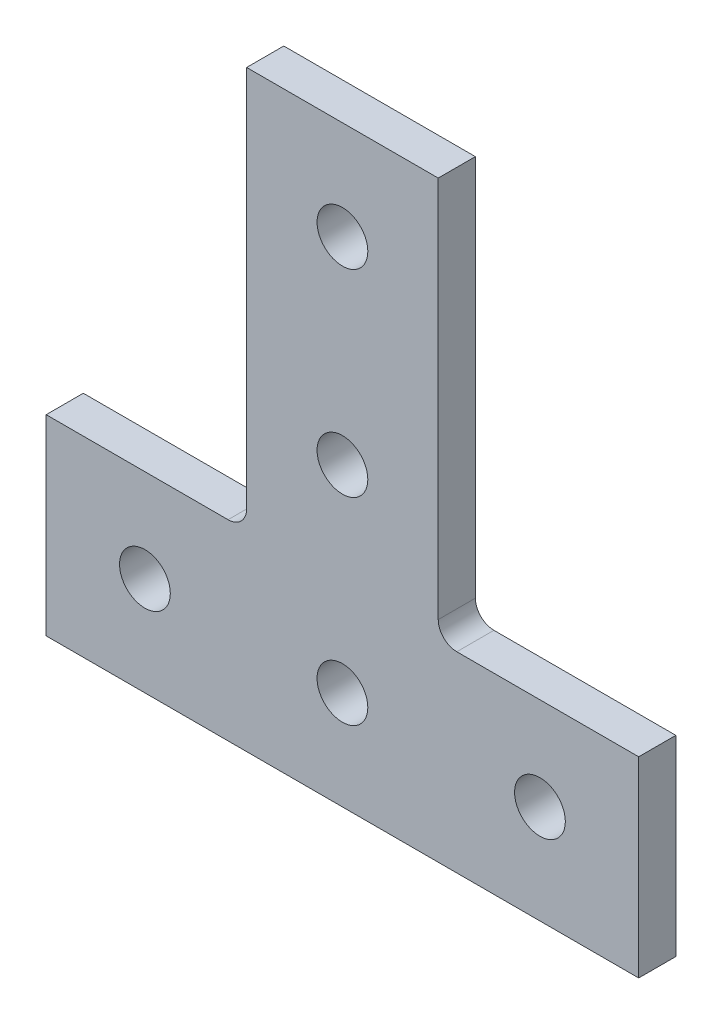
ISO-10303-21;
HEADER;
FILE_DESCRIPTION(('STEP AP214'),'2;1');
FILE_NAME('part.step','',(''),(''),'','','');
FILE_SCHEMA(('AUTOMOTIVE_DESIGN { 1 0 10303 214 1 1 1 1 }'));
ENDSEC;
DATA;
#1=APPLICATION_CONTEXT('core data for automotive mechanical design processes');
#2=APPLICATION_PROTOCOL_DEFINITION('international standard','automotive_design',2000,#1);
#3=PRODUCT_CONTEXT('',#1,'mechanical');
#4=PRODUCT('Part','Part','',(#3));
#5=PRODUCT_RELATED_PRODUCT_CATEGORY('part','',(#4));
#6=PRODUCT_DEFINITION_FORMATION('','',#4);
#7=PRODUCT_DEFINITION_CONTEXT('part definition',#1,'design');
#8=PRODUCT_DEFINITION('design','',#6,#7);
#9=PRODUCT_DEFINITION_SHAPE('','',#8);
#10=(LENGTH_UNIT() NAMED_UNIT(*) SI_UNIT(.MILLI.,.METRE.));
#11=(NAMED_UNIT(*) PLANE_ANGLE_UNIT() SI_UNIT($,.RADIAN.));
#12=(NAMED_UNIT(*) SI_UNIT($,.STERADIAN.) SOLID_ANGLE_UNIT());
#13=UNCERTAINTY_MEASURE_WITH_UNIT(LENGTH_MEASURE(1.E-05),#10,'distance_accuracy_value','');
#14=(GEOMETRIC_REPRESENTATION_CONTEXT(3) GLOBAL_UNCERTAINTY_ASSIGNED_CONTEXT((#13)) GLOBAL_UNIT_ASSIGNED_CONTEXT((#10,
#11,#12)) REPRESENTATION_CONTEXT('',''));
#15=CARTESIAN_POINT('',(0.,0.,0.));
#16=DIRECTION('',(0.,0.,1.));
#17=DIRECTION('',(1.,0.,0.));
#18=AXIS2_PLACEMENT_3D('',#15,#16,#17);
#19=CARTESIAN_POINT('',(14.7066,27.0256,4.7752));
#20=DIRECTION('',(0.,0.,-1.));
#21=DIRECTION('',(-1.,0.,0.));
#22=AXIS2_PLACEMENT_3D('',#19,#20,#21);
#23=PLANE('',#22);
#24=CARTESIAN_POINT('',(0.,12.7,4.7752));
#25=DIRECTION('',(0.,0.,1.));
#26=DIRECTION('',(1.,0.,0.));
#27=AXIS2_PLACEMENT_3D('',#24,#25,#26);
#28=CIRCLE('',#27,3.2639);
#29=CARTESIAN_POINT('',(3.2639,12.7,4.7752));
#30=VERTEX_POINT('',#29);
#31=EDGE_CURVE('E226',#30,#30,#28,.T.);
#32=ORIENTED_EDGE('',*,*,#31,.F.);
#33=EDGE_LOOP('',(#32));
#34=FACE_BOUND('',#33,.T.);
#35=CARTESIAN_POINT('',(0.,38.1,4.7752));
#36=DIRECTION('',(0.,0.,1.));
#37=DIRECTION('',(1.,0.,0.));
#38=AXIS2_PLACEMENT_3D('',#35,#36,#37);
#39=CIRCLE('',#38,3.2639);
#40=CARTESIAN_POINT('',(3.2639,38.1,4.7752));
#41=VERTEX_POINT('',#40);
#42=EDGE_CURVE('E214',#41,#41,#39,.T.);
#43=ORIENTED_EDGE('',*,*,#42,.F.);
#44=EDGE_LOOP('',(#43));
#45=FACE_BOUND('',#44,.T.);
#46=DIRECTION('',(0.,-1.,0.));
#47=VECTOR('',#46,1.);
#48=CARTESIAN_POINT('',(-38.1,24.638,4.7752));
#49=LINE('',#48,#47);
#50=CARTESIAN_POINT('',(-38.1,24.638,4.7752));
#51=VERTEX_POINT('',#50);
#52=CARTESIAN_POINT('',(-38.1,0.,4.7752));
#53=VERTEX_POINT('',#52);
#54=EDGE_CURVE('E163',#51,#53,#49,.T.);
#55=ORIENTED_EDGE('',*,*,#54,.T.);
#56=DIRECTION('',(1.,0.,0.));
#57=VECTOR('',#56,1.);
#58=CARTESIAN_POINT('',(-38.1,0.,4.7752));
#59=LINE('',#58,#57);
#60=CARTESIAN_POINT('',(38.1,0.,4.7752));
#61=VERTEX_POINT('',#60);
#62=EDGE_CURVE('E101',#53,#61,#59,.T.);
#63=ORIENTED_EDGE('',*,*,#62,.T.);
#64=DIRECTION('',(0.,1.,0.));
#65=VECTOR('',#64,1.);
#66=CARTESIAN_POINT('',(38.1,0.,4.7752));
#67=LINE('',#66,#65);
#68=CARTESIAN_POINT('',(38.1,24.638,4.7752));
#69=VERTEX_POINT('',#68);
#70=EDGE_CURVE('E184',#61,#69,#67,.T.);
#71=ORIENTED_EDGE('',*,*,#70,.T.);
#72=DIRECTION('',(-1.,0.,0.));
#73=VECTOR('',#72,1.);
#74=CARTESIAN_POINT('',(38.1,24.638,4.7752));
#75=LINE('',#74,#73);
#76=CARTESIAN_POINT('',(14.7066,24.638,4.7752));
#77=VERTEX_POINT('',#76);
#78=EDGE_CURVE('E203',#69,#77,#75,.T.);
#79=ORIENTED_EDGE('',*,*,#78,.T.);
#80=CARTESIAN_POINT('',(14.7066,27.0256,4.7752));
#81=DIRECTION('',(0.,0.,-1.));
#82=DIRECTION('',(-1.,0.,0.));
#83=AXIS2_PLACEMENT_3D('',#80,#81,#82);
#84=CIRCLE('',#83,2.38760000000001);
#85=CARTESIAN_POINT('',(12.319,27.0256,4.7752));
#86=VERTEX_POINT('',#85);
#87=EDGE_CURVE('E200',#77,#86,#84,.T.);
#88=ORIENTED_EDGE('',*,*,#87,.T.);
#89=DIRECTION('',(0.,1.,0.));
#90=VECTOR('',#89,1.);
#91=CARTESIAN_POINT('',(12.319,27.0256,4.7752));
#92=LINE('',#91,#90);
#93=CARTESIAN_POINT('',(12.319,76.2,4.7752));
#94=VERTEX_POINT('',#93);
#95=EDGE_CURVE('E202',#86,#94,#92,.T.);
#96=ORIENTED_EDGE('',*,*,#95,.T.);
#97=DIRECTION('',(-1.,0.,0.));
#98=VECTOR('',#97,1.);
#99=CARTESIAN_POINT('',(12.319,76.2,4.7752));
#100=LINE('',#99,#98);
#101=CARTESIAN_POINT('',(-12.319,76.2,4.7752));
#102=VERTEX_POINT('',#101);
#103=EDGE_CURVE('E126',#94,#102,#100,.T.);
#104=ORIENTED_EDGE('',*,*,#103,.T.);
#105=DIRECTION('',(0.,-1.,0.));
#106=VECTOR('',#105,1.);
#107=CARTESIAN_POINT('',(-12.319,76.2,4.7752));
#108=LINE('',#107,#106);
#109=CARTESIAN_POINT('',(-12.319,27.0256,4.7752));
#110=VERTEX_POINT('',#109);
#111=EDGE_CURVE('E120',#102,#110,#108,.T.);
#112=ORIENTED_EDGE('',*,*,#111,.T.);
#113=CARTESIAN_POINT('',(-14.7066,27.0256,4.7752));
#114=DIRECTION('',(0.,0.,-1.));
#115=DIRECTION('',(-1.,0.,0.));
#116=AXIS2_PLACEMENT_3D('',#113,#114,#115);
#117=CIRCLE('',#116,2.3876);
#118=CARTESIAN_POINT('',(-14.7066,24.638,4.7752));
#119=VERTEX_POINT('',#118);
#120=EDGE_CURVE('E124',#110,#119,#117,.T.);
#121=ORIENTED_EDGE('',*,*,#120,.T.);
#122=DIRECTION('',(-1.,0.,0.));
#123=VECTOR('',#122,1.);
#124=CARTESIAN_POINT('',(-14.7066,24.638,4.7752));
#125=LINE('',#124,#123);
#126=EDGE_CURVE('E52',#119,#51,#125,.T.);
#127=ORIENTED_EDGE('',*,*,#126,.T.);
#128=EDGE_LOOP('',(#55,#63,#71,#79,#88,#96,#104,#112,#121,#127));
#129=FACE_BOUND('',#128,.T.);
#130=CARTESIAN_POINT('',(25.4,12.7,4.7752));
#131=DIRECTION('',(0.,0.,1.));
#132=DIRECTION('',(1.,0.,0.));
#133=AXIS2_PLACEMENT_3D('',#130,#131,#132);
#134=CIRCLE('',#133,3.2639);
#135=CARTESIAN_POINT('',(28.6639,12.7,4.7752));
#136=VERTEX_POINT('',#135);
#137=EDGE_CURVE('E148',#136,#136,#134,.T.);
#138=ORIENTED_EDGE('',*,*,#137,.F.);
#139=EDGE_LOOP('',(#138));
#140=FACE_BOUND('',#139,.T.);
#141=CARTESIAN_POINT('',(0.,63.5,4.7752));
#142=DIRECTION('',(0.,0.,1.));
#143=DIRECTION('',(1.,0.,0.));
#144=AXIS2_PLACEMENT_3D('',#141,#142,#143);
#145=CIRCLE('',#144,3.2639);
#146=CARTESIAN_POINT('',(3.2639,63.5,4.7752));
#147=VERTEX_POINT('',#146);
#148=EDGE_CURVE('E220',#147,#147,#145,.T.);
#149=ORIENTED_EDGE('',*,*,#148,.F.);
#150=EDGE_LOOP('',(#149));
#151=FACE_BOUND('',#150,.T.);
#152=CARTESIAN_POINT('',(-25.4,12.7,4.7752));
#153=DIRECTION('',(0.,0.,1.));
#154=DIRECTION('',(1.,0.,0.));
#155=AXIS2_PLACEMENT_3D('',#152,#153,#154);
#156=CIRCLE('',#155,3.2639);
#157=CARTESIAN_POINT('',(-22.1361,12.7,4.7752));
#158=VERTEX_POINT('',#157);
#159=EDGE_CURVE('E232',#158,#158,#156,.T.);
#160=ORIENTED_EDGE('',*,*,#159,.F.);
#161=EDGE_LOOP('',(#160));
#162=FACE_BOUND('',#161,.T.);
#163=ADVANCED_FACE('F35',(#34,#45,#129,#140,#151,#162),#23,.F.);
#164=CARTESIAN_POINT('',(14.7066,27.0256,0.));
#165=DIRECTION('',(0.,0.,-1.));
#166=DIRECTION('',(-1.,0.,0.));
#167=AXIS2_PLACEMENT_3D('',#164,#165,#166);
#168=PLANE('',#167);
#169=CARTESIAN_POINT('',(0.,12.7,0.));
#170=DIRECTION('',(0.,0.,1.));
#171=DIRECTION('',(1.,0.,0.));
#172=AXIS2_PLACEMENT_3D('',#169,#170,#171);
#173=CIRCLE('',#172,3.2639);
#174=CARTESIAN_POINT('',(3.2639,12.7,0.));
#175=VERTEX_POINT('',#174);
#176=EDGE_CURVE('E229',#175,#175,#173,.T.);
#177=ORIENTED_EDGE('',*,*,#176,.T.);
#178=EDGE_LOOP('',(#177));
#179=FACE_BOUND('',#178,.T.);
#180=CARTESIAN_POINT('',(0.,38.1,0.));
#181=DIRECTION('',(0.,0.,1.));
#182=DIRECTION('',(1.,0.,0.));
#183=AXIS2_PLACEMENT_3D('',#180,#181,#182);
#184=CIRCLE('',#183,3.2639);
#185=CARTESIAN_POINT('',(3.2639,38.1,0.));
#186=VERTEX_POINT('',#185);
#187=EDGE_CURVE('E217',#186,#186,#184,.T.);
#188=ORIENTED_EDGE('',*,*,#187,.T.);
#189=EDGE_LOOP('',(#188));
#190=FACE_BOUND('',#189,.T.);
#191=DIRECTION('',(0.,-1.,0.));
#192=VECTOR('',#191,1.);
#193=CARTESIAN_POINT('',(-38.1,24.638,0.));
#194=LINE('',#193,#192);
#195=CARTESIAN_POINT('',(-38.1,24.638,0.));
#196=VERTEX_POINT('',#195);
#197=CARTESIAN_POINT('',(-38.1,0.,0.));
#198=VERTEX_POINT('',#197);
#199=EDGE_CURVE('E144',#196,#198,#194,.T.);
#200=ORIENTED_EDGE('',*,*,#199,.F.);
#201=DIRECTION('',(-1.,0.,0.));
#202=VECTOR('',#201,1.);
#203=CARTESIAN_POINT('',(-14.7066,24.638,0.));
#204=LINE('',#203,#202);
#205=CARTESIAN_POINT('',(-14.7066,24.638,0.));
#206=VERTEX_POINT('',#205);
#207=EDGE_CURVE('E93',#206,#196,#204,.T.);
#208=ORIENTED_EDGE('',*,*,#207,.F.);
#209=CARTESIAN_POINT('',(-14.7066,27.0256,0.));
#210=DIRECTION('',(0.,0.,-1.));
#211=DIRECTION('',(-1.,0.,0.));
#212=AXIS2_PLACEMENT_3D('',#209,#210,#211);
#213=CIRCLE('',#212,2.3876);
#214=CARTESIAN_POINT('',(-12.319,27.0256,0.));
#215=VERTEX_POINT('',#214);
#216=EDGE_CURVE('E87',#215,#206,#213,.T.);
#217=ORIENTED_EDGE('',*,*,#216,.F.);
#218=DIRECTION('',(0.,-1.,0.));
#219=VECTOR('',#218,1.);
#220=CARTESIAN_POINT('',(-12.319,76.2,0.));
#221=LINE('',#220,#219);
#222=CARTESIAN_POINT('',(-12.319,76.2,0.));
#223=VERTEX_POINT('',#222);
#224=EDGE_CURVE('E134',#223,#215,#221,.T.);
#225=ORIENTED_EDGE('',*,*,#224,.F.);
#226=DIRECTION('',(-1.,0.,0.));
#227=VECTOR('',#226,1.);
#228=CARTESIAN_POINT('',(12.319,76.2,0.));
#229=LINE('',#228,#227);
#230=CARTESIAN_POINT('',(12.319,76.2,0.));
#231=VERTEX_POINT('',#230);
#232=EDGE_CURVE('E158',#231,#223,#229,.T.);
#233=ORIENTED_EDGE('',*,*,#232,.F.);
#234=DIRECTION('',(0.,1.,0.));
#235=VECTOR('',#234,1.);
#236=CARTESIAN_POINT('',(12.319,27.0256,0.));
#237=LINE('',#236,#235);
#238=CARTESIAN_POINT('',(12.319,27.0256,0.));
#239=VERTEX_POINT('',#238);
#240=EDGE_CURVE('E156',#239,#231,#237,.T.);
#241=ORIENTED_EDGE('',*,*,#240,.F.);
#242=CARTESIAN_POINT('',(14.7066,27.0256,0.));
#243=DIRECTION('',(0.,0.,-1.));
#244=DIRECTION('',(-1.,0.,0.));
#245=AXIS2_PLACEMENT_3D('',#242,#243,#244);
#246=CIRCLE('',#245,2.38760000000001);
#247=CARTESIAN_POINT('',(14.7066,24.638,0.));
#248=VERTEX_POINT('',#247);
#249=EDGE_CURVE('E154',#248,#239,#246,.T.);
#250=ORIENTED_EDGE('',*,*,#249,.F.);
#251=DIRECTION('',(-1.,0.,0.));
#252=VECTOR('',#251,1.);
#253=CARTESIAN_POINT('',(38.1,24.638,0.));
#254=LINE('',#253,#252);
#255=CARTESIAN_POINT('',(38.1,24.638,0.));
#256=VERTEX_POINT('',#255);
#257=EDGE_CURVE('E152',#256,#248,#254,.T.);
#258=ORIENTED_EDGE('',*,*,#257,.F.);
#259=DIRECTION('',(0.,1.,0.));
#260=VECTOR('',#259,1.);
#261=CARTESIAN_POINT('',(38.1,0.,0.));
#262=LINE('',#261,#260);
#263=CARTESIAN_POINT('',(38.1,0.,0.));
#264=VERTEX_POINT('',#263);
#265=EDGE_CURVE('E150',#264,#256,#262,.T.);
#266=ORIENTED_EDGE('',*,*,#265,.F.);
#267=DIRECTION('',(1.,0.,0.));
#268=VECTOR('',#267,1.);
#269=CARTESIAN_POINT('',(-38.1,0.,0.));
#270=LINE('',#269,#268);
#271=EDGE_CURVE('E147',#198,#264,#270,.T.);
#272=ORIENTED_EDGE('',*,*,#271,.F.);
#273=EDGE_LOOP('',(#200,#208,#217,#225,#233,#241,#250,#258,#266,#272));
#274=FACE_BOUND('',#273,.T.);
#275=CARTESIAN_POINT('',(25.4,12.7,0.));
#276=DIRECTION('',(0.,0.,1.));
#277=DIRECTION('',(1.,0.,0.));
#278=AXIS2_PLACEMENT_3D('',#275,#276,#277);
#279=CIRCLE('',#278,3.2639);
#280=CARTESIAN_POINT('',(28.6639,12.7,0.));
#281=VERTEX_POINT('',#280);
#282=EDGE_CURVE('E211',#281,#281,#279,.T.);
#283=ORIENTED_EDGE('',*,*,#282,.T.);
#284=EDGE_LOOP('',(#283));
#285=FACE_BOUND('',#284,.T.);
#286=CARTESIAN_POINT('',(0.,63.5,0.));
#287=DIRECTION('',(0.,0.,1.));
#288=DIRECTION('',(1.,0.,0.));
#289=AXIS2_PLACEMENT_3D('',#286,#287,#288);
#290=CIRCLE('',#289,3.2639);
#291=CARTESIAN_POINT('',(3.2639,63.5,0.));
#292=VERTEX_POINT('',#291);
#293=EDGE_CURVE('E223',#292,#292,#290,.T.);
#294=ORIENTED_EDGE('',*,*,#293,.T.);
#295=EDGE_LOOP('',(#294));
#296=FACE_BOUND('',#295,.T.);
#297=CARTESIAN_POINT('',(-25.4,12.7,0.));
#298=DIRECTION('',(0.,0.,1.));
#299=DIRECTION('',(1.,0.,0.));
#300=AXIS2_PLACEMENT_3D('',#297,#298,#299);
#301=CIRCLE('',#300,3.2639);
#302=CARTESIAN_POINT('',(-22.1361,12.7,0.));
#303=VERTEX_POINT('',#302);
#304=EDGE_CURVE('E235',#303,#303,#301,.T.);
#305=ORIENTED_EDGE('',*,*,#304,.T.);
#306=EDGE_LOOP('',(#305));
#307=FACE_BOUND('',#306,.T.);
#308=ADVANCED_FACE('F188',(#179,#190,#274,#285,#296,#307),#168,.T.);
#309=CARTESIAN_POINT('',(-38.1,24.638,4.7752));
#310=DIRECTION('',(1.,0.,0.));
#311=DIRECTION('',(0.,0.,-1.));
#312=AXIS2_PLACEMENT_3D('',#309,#310,#311);
#313=PLANE('',#312);
#314=ORIENTED_EDGE('',*,*,#199,.T.);
#315=DIRECTION('',(0.,0.,-1.));
#316=VECTOR('',#315,1.);
#317=CARTESIAN_POINT('',(-38.1,0.,4.7752));
#318=LINE('',#317,#316);
#319=EDGE_CURVE('E11',#53,#198,#318,.T.);
#320=ORIENTED_EDGE('',*,*,#319,.F.);
#321=ORIENTED_EDGE('',*,*,#54,.F.);
#322=DIRECTION('',(0.,0.,-1.));
#323=VECTOR('',#322,1.);
#324=CARTESIAN_POINT('',(-38.1,24.638,4.7752));
#325=LINE('',#324,#323);
#326=EDGE_CURVE('E140',#51,#196,#325,.T.);
#327=ORIENTED_EDGE('',*,*,#326,.T.);
#328=EDGE_LOOP('',(#314,#320,#321,#327));
#329=FACE_BOUND('',#328,.T.);
#330=ADVANCED_FACE('F37',(#329),#313,.F.);
#331=CARTESIAN_POINT('',(-38.1,0.,4.7752));
#332=DIRECTION('',(0.,1.,0.));
#333=DIRECTION('',(0.,0.,1.));
#334=AXIS2_PLACEMENT_3D('',#331,#332,#333);
#335=PLANE('',#334);
#336=ORIENTED_EDGE('',*,*,#271,.T.);
#337=DIRECTION('',(0.,0.,-1.));
#338=VECTOR('',#337,1.);
#339=CARTESIAN_POINT('',(38.1,0.,4.7752));
#340=LINE('',#339,#338);
#341=EDGE_CURVE('E44',#61,#264,#340,.T.);
#342=ORIENTED_EDGE('',*,*,#341,.F.);
#343=ORIENTED_EDGE('',*,*,#62,.F.);
#344=ORIENTED_EDGE('',*,*,#319,.T.);
#345=EDGE_LOOP('',(#336,#342,#343,#344));
#346=FACE_BOUND('',#345,.T.);
#347=ADVANCED_FACE('F278',(#346),#335,.F.);
#348=CARTESIAN_POINT('',(38.1,0.,4.7752));
#349=DIRECTION('',(-1.,0.,0.));
#350=DIRECTION('',(0.,0.,1.));
#351=AXIS2_PLACEMENT_3D('',#348,#349,#350);
#352=PLANE('',#351);
#353=ORIENTED_EDGE('',*,*,#265,.T.);
#354=DIRECTION('',(0.,0.,-1.));
#355=VECTOR('',#354,1.);
#356=CARTESIAN_POINT('',(38.1,24.638,4.7752));
#357=LINE('',#356,#355);
#358=EDGE_CURVE('E176',#69,#256,#357,.T.);
#359=ORIENTED_EDGE('',*,*,#358,.F.);
#360=ORIENTED_EDGE('',*,*,#70,.F.);
#361=ORIENTED_EDGE('',*,*,#341,.T.);
#362=EDGE_LOOP('',(#353,#359,#360,#361));
#363=FACE_BOUND('',#362,.T.);
#364=ADVANCED_FACE('F182',(#363),#352,.F.);
#365=CARTESIAN_POINT('',(38.1,24.638,4.7752));
#366=DIRECTION('',(0.,-1.,0.));
#367=DIRECTION('',(0.,0.,-1.));
#368=AXIS2_PLACEMENT_3D('',#365,#366,#367);
#369=PLANE('',#368);
#370=ORIENTED_EDGE('',*,*,#257,.T.);
#371=DIRECTION('',(0.,0.,-1.));
#372=VECTOR('',#371,1.);
#373=CARTESIAN_POINT('',(14.7066,24.638,4.7752));
#374=LINE('',#373,#372);
#375=EDGE_CURVE('E173',#77,#248,#374,.T.);
#376=ORIENTED_EDGE('',*,*,#375,.F.);
#377=ORIENTED_EDGE('',*,*,#78,.F.);
#378=ORIENTED_EDGE('',*,*,#358,.T.);
#379=EDGE_LOOP('',(#370,#376,#377,#378));
#380=FACE_BOUND('',#379,.T.);
#381=ADVANCED_FACE('F194',(#380),#369,.F.);
#382=CARTESIAN_POINT('',(14.7066,27.0256,4.7752));
#383=DIRECTION('',(0.,0.,-1.));
#384=DIRECTION('',(-1.,0.,0.));
#385=AXIS2_PLACEMENT_3D('',#382,#383,#384);
#386=CYLINDRICAL_SURFACE('',#385,2.38760000000001);
#387=ORIENTED_EDGE('',*,*,#249,.T.);
#388=DIRECTION('',(0.,0.,-1.));
#389=VECTOR('',#388,1.);
#390=CARTESIAN_POINT('',(12.319,27.0256,4.7752));
#391=LINE('',#390,#389);
#392=EDGE_CURVE('E170',#86,#239,#391,.T.);
#393=ORIENTED_EDGE('',*,*,#392,.F.);
#394=ORIENTED_EDGE('',*,*,#87,.F.);
#395=ORIENTED_EDGE('',*,*,#375,.T.);
#396=EDGE_LOOP('',(#387,#393,#394,#395));
#397=FACE_BOUND('',#396,.T.);
#398=ADVANCED_FACE('F198',(#397),#386,.F.);
#399=CARTESIAN_POINT('',(12.319,27.0256,4.7752));
#400=DIRECTION('',(-1.,0.,0.));
#401=DIRECTION('',(0.,0.,1.));
#402=AXIS2_PLACEMENT_3D('',#399,#400,#401);
#403=PLANE('',#402);
#404=ORIENTED_EDGE('',*,*,#240,.T.);
#405=DIRECTION('',(0.,0.,-1.));
#406=VECTOR('',#405,1.);
#407=CARTESIAN_POINT('',(12.319,76.2,4.7752));
#408=LINE('',#407,#406);
#409=EDGE_CURVE('E167',#94,#231,#408,.T.);
#410=ORIENTED_EDGE('',*,*,#409,.F.);
#411=ORIENTED_EDGE('',*,*,#95,.F.);
#412=ORIENTED_EDGE('',*,*,#392,.T.);
#413=EDGE_LOOP('',(#404,#410,#411,#412));
#414=FACE_BOUND('',#413,.T.);
#415=ADVANCED_FACE('F268',(#414),#403,.F.);
#416=CARTESIAN_POINT('',(12.319,76.2,4.7752));
#417=DIRECTION('',(0.,-1.,0.));
#418=DIRECTION('',(0.,0.,-1.));
#419=AXIS2_PLACEMENT_3D('',#416,#417,#418);
#420=PLANE('',#419);
#421=ORIENTED_EDGE('',*,*,#232,.T.);
#422=DIRECTION('',(0.,0.,-1.));
#423=VECTOR('',#422,1.);
#424=CARTESIAN_POINT('',(-12.319,76.2,4.7752));
#425=LINE('',#424,#423);
#426=EDGE_CURVE('E135',#102,#223,#425,.T.);
#427=ORIENTED_EDGE('',*,*,#426,.F.);
#428=ORIENTED_EDGE('',*,*,#103,.F.);
#429=ORIENTED_EDGE('',*,*,#409,.T.);
#430=EDGE_LOOP('',(#421,#427,#428,#429));
#431=FACE_BOUND('',#430,.T.);
#432=ADVANCED_FACE('F265',(#431),#420,.F.);
#433=CARTESIAN_POINT('',(-12.319,76.2,4.7752));
#434=DIRECTION('',(1.,0.,0.));
#435=DIRECTION('',(0.,0.,-1.));
#436=AXIS2_PLACEMENT_3D('',#433,#434,#435);
#437=PLANE('',#436);
#438=ORIENTED_EDGE('',*,*,#224,.T.);
#439=DIRECTION('',(0.,0.,-1.));
#440=VECTOR('',#439,1.);
#441=CARTESIAN_POINT('',(-12.319,27.0256,4.7752));
#442=LINE('',#441,#440);
#443=EDGE_CURVE('E131',#110,#215,#442,.T.);
#444=ORIENTED_EDGE('',*,*,#443,.F.);
#445=ORIENTED_EDGE('',*,*,#111,.F.);
#446=ORIENTED_EDGE('',*,*,#426,.T.);
#447=EDGE_LOOP('',(#438,#444,#445,#446));
#448=FACE_BOUND('',#447,.T.);
#449=ADVANCED_FACE('F132',(#448),#437,.F.);
#450=CARTESIAN_POINT('',(-14.7066,27.0256,4.7752));
#451=DIRECTION('',(0.,0.,-1.));
#452=DIRECTION('',(-1.,0.,0.));
#453=AXIS2_PLACEMENT_3D('',#450,#451,#452);
#454=CYLINDRICAL_SURFACE('',#453,2.3876);
#455=ORIENTED_EDGE('',*,*,#216,.T.);
#456=DIRECTION('',(0.,0.,-1.));
#457=VECTOR('',#456,1.);
#458=CARTESIAN_POINT('',(-14.7066,24.638,4.7752));
#459=LINE('',#458,#457);
#460=EDGE_CURVE('E136',#119,#206,#459,.T.);
#461=ORIENTED_EDGE('',*,*,#460,.F.);
#462=ORIENTED_EDGE('',*,*,#120,.F.);
#463=ORIENTED_EDGE('',*,*,#443,.T.);
#464=EDGE_LOOP('',(#455,#461,#462,#463));
#465=FACE_BOUND('',#464,.T.);
#466=ADVANCED_FACE('F138',(#465),#454,.F.);
#467=CARTESIAN_POINT('',(-14.7066,24.638,4.7752));
#468=DIRECTION('',(0.,-1.,0.));
#469=DIRECTION('',(0.,0.,-1.));
#470=AXIS2_PLACEMENT_3D('',#467,#468,#469);
#471=PLANE('',#470);
#472=ORIENTED_EDGE('',*,*,#207,.T.);
#473=ORIENTED_EDGE('',*,*,#326,.F.);
#474=ORIENTED_EDGE('',*,*,#126,.F.);
#475=ORIENTED_EDGE('',*,*,#460,.T.);
#476=EDGE_LOOP('',(#472,#473,#474,#475));
#477=FACE_BOUND('',#476,.T.);
#478=ADVANCED_FACE('F258',(#477),#471,.F.);
#479=CARTESIAN_POINT('',(25.4,12.7,4.7752));
#480=DIRECTION('',(0.,0.,-1.));
#481=DIRECTION('',(-1.,0.,0.));
#482=AXIS2_PLACEMENT_3D('',#479,#480,#481);
#483=CYLINDRICAL_SURFACE('',#482,3.2639);
#484=ORIENTED_EDGE('',*,*,#137,.T.);
#485=EDGE_LOOP('',(#484));
#486=FACE_BOUND('',#485,.T.);
#487=ORIENTED_EDGE('',*,*,#282,.F.);
#488=EDGE_LOOP('',(#487));
#489=FACE_BOUND('',#488,.T.);
#490=ADVANCED_FACE('F255',(#486,#489),#483,.F.);
#491=CARTESIAN_POINT('',(0.,38.1,4.7752));
#492=DIRECTION('',(0.,0.,-1.));
#493=DIRECTION('',(-1.,0.,0.));
#494=AXIS2_PLACEMENT_3D('',#491,#492,#493);
#495=CYLINDRICAL_SURFACE('',#494,3.2639);
#496=ORIENTED_EDGE('',*,*,#42,.T.);
#497=EDGE_LOOP('',(#496));
#498=FACE_BOUND('',#497,.T.);
#499=ORIENTED_EDGE('',*,*,#187,.F.);
#500=EDGE_LOOP('',(#499));
#501=FACE_BOUND('',#500,.T.);
#502=ADVANCED_FACE('F354',(#498,#501),#495,.F.);
#503=CARTESIAN_POINT('',(0.,63.5,4.7752));
#504=DIRECTION('',(0.,0.,-1.));
#505=DIRECTION('',(-1.,0.,0.));
#506=AXIS2_PLACEMENT_3D('',#503,#504,#505);
#507=CYLINDRICAL_SURFACE('',#506,3.2639);
#508=ORIENTED_EDGE('',*,*,#148,.T.);
#509=EDGE_LOOP('',(#508));
#510=FACE_BOUND('',#509,.T.);
#511=ORIENTED_EDGE('',*,*,#293,.F.);
#512=EDGE_LOOP('',(#511));
#513=FACE_BOUND('',#512,.T.);
#514=ADVANCED_FACE('F362',(#510,#513),#507,.F.);
#515=CARTESIAN_POINT('',(0.,12.7,4.7752));
#516=DIRECTION('',(0.,0.,-1.));
#517=DIRECTION('',(-1.,0.,0.));
#518=AXIS2_PLACEMENT_3D('',#515,#516,#517);
#519=CYLINDRICAL_SURFACE('',#518,3.2639);
#520=ORIENTED_EDGE('',*,*,#31,.T.);
#521=EDGE_LOOP('',(#520));
#522=FACE_BOUND('',#521,.T.);
#523=ORIENTED_EDGE('',*,*,#176,.F.);
#524=EDGE_LOOP('',(#523));
#525=FACE_BOUND('',#524,.T.);
#526=ADVANCED_FACE('F370',(#522,#525),#519,.F.);
#527=CARTESIAN_POINT('',(-25.4,12.7,4.7752));
#528=DIRECTION('',(0.,0.,-1.));
#529=DIRECTION('',(-1.,0.,0.));
#530=AXIS2_PLACEMENT_3D('',#527,#528,#529);
#531=CYLINDRICAL_SURFACE('',#530,3.2639);
#532=ORIENTED_EDGE('',*,*,#159,.T.);
#533=EDGE_LOOP('',(#532));
#534=FACE_BOUND('',#533,.T.);
#535=ORIENTED_EDGE('',*,*,#304,.F.);
#536=EDGE_LOOP('',(#535));
#537=FACE_BOUND('',#536,.T.);
#538=ADVANCED_FACE('F241',(#534,#537),#531,.F.);
#539=CLOSED_SHELL('',(#163,#308,#330,#347,#364,#381,#398,#415,#432,#449,#466,#478,#490,#502,
#514,#526,#538));
#540=MANIFOLD_SOLID_BREP('B2',#539);
#541=ADVANCED_BREP_SHAPE_REPRESENTATION('',(#18,#540),#14);
#542=SHAPE_DEFINITION_REPRESENTATION(#9,#541);
ENDSEC;
END-ISO-10303-21;
